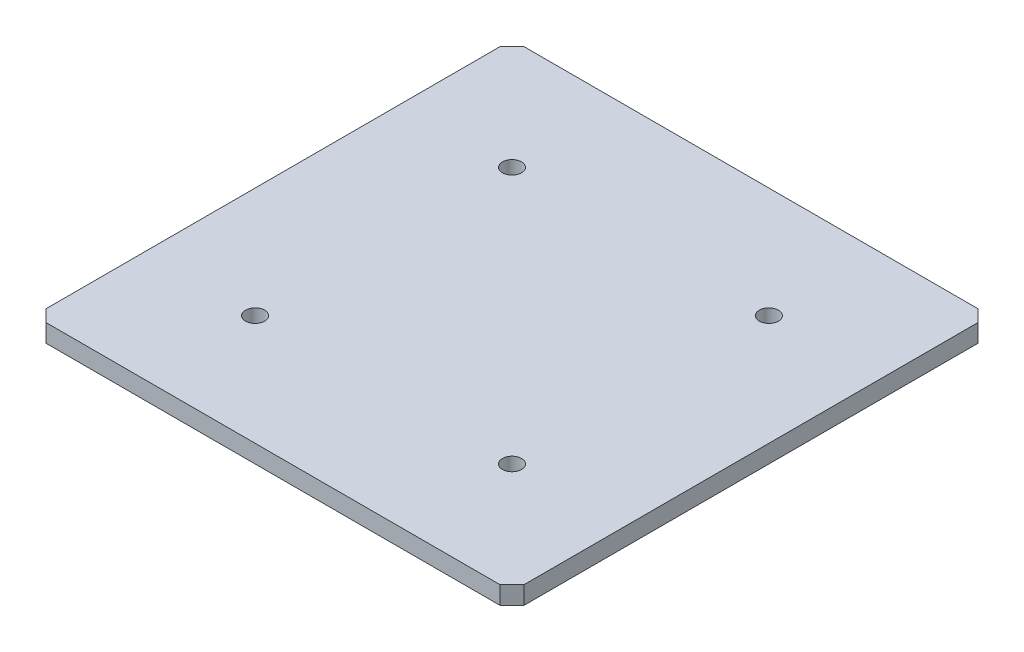
ISO-10303-21;
HEADER;
FILE_DESCRIPTION(('STEP AP214'),'2;1');
FILE_NAME('part.step','',(''),(''),'','','');
FILE_SCHEMA(('AUTOMOTIVE_DESIGN { 1 0 10303 214 1 1 1 1 }'));
ENDSEC;
DATA;
#1=APPLICATION_CONTEXT('core data for automotive mechanical design processes');
#2=APPLICATION_PROTOCOL_DEFINITION('international standard','automotive_design',2000,#1);
#3=PRODUCT_CONTEXT('',#1,'mechanical');
#4=PRODUCT('Part','Part','',(#3));
#5=PRODUCT_RELATED_PRODUCT_CATEGORY('part','',(#4));
#6=PRODUCT_DEFINITION_FORMATION('','',#4);
#7=PRODUCT_DEFINITION_CONTEXT('part definition',#1,'design');
#8=PRODUCT_DEFINITION('design','',#6,#7);
#9=PRODUCT_DEFINITION_SHAPE('','',#8);
#10=(LENGTH_UNIT() NAMED_UNIT(*) SI_UNIT(.MILLI.,.METRE.));
#11=(NAMED_UNIT(*) PLANE_ANGLE_UNIT() SI_UNIT($,.RADIAN.));
#12=(NAMED_UNIT(*) SI_UNIT($,.STERADIAN.) SOLID_ANGLE_UNIT());
#13=UNCERTAINTY_MEASURE_WITH_UNIT(LENGTH_MEASURE(1.E-05),#10,'distance_accuracy_value','');
#14=(GEOMETRIC_REPRESENTATION_CONTEXT(3) GLOBAL_UNCERTAINTY_ASSIGNED_CONTEXT((#13)) GLOBAL_UNIT_ASSIGNED_CONTEXT((#10,
#11,#12)) REPRESENTATION_CONTEXT('',''));
#15=CARTESIAN_POINT('',(0.,0.,0.));
#16=DIRECTION('',(0.,0.,1.));
#17=DIRECTION('',(1.,0.,0.));
#18=AXIS2_PLACEMENT_3D('',#15,#16,#17);
#19=CARTESIAN_POINT('',(0.,7.5,0.));
#20=DIRECTION('',(1.,0.,0.));
#21=DIRECTION('',(0.,0.,-1.));
#22=AXIS2_PLACEMENT_3D('',#19,#20,#21);
#23=PLANE('',#22);
#24=DIRECTION('',(0.,0.,1.));
#25=VECTOR('',#24,1.);
#26=CARTESIAN_POINT('',(0.,7.5,0.));
#27=LINE('',#26,#25);
#28=CARTESIAN_POINT('',(0.,7.5,-390.));
#29=VERTEX_POINT('',#28);
#30=CARTESIAN_POINT('',(0.,7.5,-10.0000000000001));
#31=VERTEX_POINT('',#30);
#32=EDGE_CURVE('E132',#29,#31,#27,.T.);
#33=ORIENTED_EDGE('',*,*,#32,.F.);
#34=DIRECTION('',(0.,-1.,0.));
#35=VECTOR('',#34,1.);
#36=CARTESIAN_POINT('',(0.,7.5,-390.));
#37=LINE('',#36,#35);
#38=CARTESIAN_POINT('',(0.,-7.5,-390.));
#39=VERTEX_POINT('',#38);
#40=EDGE_CURVE('E116',#29,#39,#37,.T.);
#41=ORIENTED_EDGE('',*,*,#40,.T.);
#42=DIRECTION('',(0.,0.,1.));
#43=VECTOR('',#42,1.);
#44=CARTESIAN_POINT('',(0.,-7.5,0.));
#45=LINE('',#44,#43);
#46=CARTESIAN_POINT('',(0.,-7.5,-10.0000000000001));
#47=VERTEX_POINT('',#46);
#48=EDGE_CURVE('E129',#39,#47,#45,.T.);
#49=ORIENTED_EDGE('',*,*,#48,.T.);
#50=DIRECTION('',(0.,1.,0.));
#51=VECTOR('',#50,1.);
#52=CARTESIAN_POINT('',(0.,7.5,-10.0000000000001));
#53=LINE('',#52,#51);
#54=EDGE_CURVE('E135',#47,#31,#53,.T.);
#55=ORIENTED_EDGE('',*,*,#54,.T.);
#56=EDGE_LOOP('',(#33,#41,#49,#55));
#57=FACE_BOUND('',#56,.T.);
#58=ADVANCED_FACE('F41',(#57),#23,.F.);
#59=CARTESIAN_POINT('',(0.,7.5,0.));
#60=DIRECTION('',(0.,0.,-1.));
#61=DIRECTION('',(-1.,0.,0.));
#62=AXIS2_PLACEMENT_3D('',#59,#60,#61);
#63=PLANE('',#62);
#64=DIRECTION('',(1.,0.,0.));
#65=VECTOR('',#64,1.);
#66=CARTESIAN_POINT('',(0.,7.5,0.));
#67=LINE('',#66,#65);
#68=CARTESIAN_POINT('',(10.,7.5,0.));
#69=VERTEX_POINT('',#68);
#70=CARTESIAN_POINT('',(390.,7.5,0.));
#71=VERTEX_POINT('',#70);
#72=EDGE_CURVE('E236',#69,#71,#67,.T.);
#73=ORIENTED_EDGE('',*,*,#72,.F.);
#74=DIRECTION('',(0.,-1.,0.));
#75=VECTOR('',#74,1.);
#76=CARTESIAN_POINT('',(10.,7.5,0.));
#77=LINE('',#76,#75);
#78=CARTESIAN_POINT('',(10.,-7.5,0.));
#79=VERTEX_POINT('',#78);
#80=EDGE_CURVE('E11',#69,#79,#77,.T.);
#81=ORIENTED_EDGE('',*,*,#80,.T.);
#82=DIRECTION('',(1.,0.,0.));
#83=VECTOR('',#82,1.);
#84=CARTESIAN_POINT('',(0.,-7.5,0.));
#85=LINE('',#84,#83);
#86=CARTESIAN_POINT('',(390.,-7.5,0.));
#87=VERTEX_POINT('',#86);
#88=EDGE_CURVE('E141',#79,#87,#85,.T.);
#89=ORIENTED_EDGE('',*,*,#88,.T.);
#90=DIRECTION('',(0.,1.,0.));
#91=VECTOR('',#90,1.);
#92=CARTESIAN_POINT('',(390.,7.5,0.));
#93=LINE('',#92,#91);
#94=EDGE_CURVE('E52',#87,#71,#93,.T.);
#95=ORIENTED_EDGE('',*,*,#94,.T.);
#96=EDGE_LOOP('',(#73,#81,#89,#95));
#97=FACE_BOUND('',#96,.T.);
#98=ADVANCED_FACE('F256',(#97),#63,.F.);
#99=CARTESIAN_POINT('',(400.,7.5,0.));
#100=DIRECTION('',(-1.,0.,0.));
#101=DIRECTION('',(0.,0.,1.));
#102=AXIS2_PLACEMENT_3D('',#99,#100,#101);
#103=PLANE('',#102);
#104=DIRECTION('',(0.,0.,-1.));
#105=VECTOR('',#104,1.);
#106=CARTESIAN_POINT('',(400.,-7.5,0.));
#107=LINE('',#106,#105);
#108=CARTESIAN_POINT('',(400.,-7.5,-10.));
#109=VERTEX_POINT('',#108);
#110=CARTESIAN_POINT('',(400.,-7.5,-390.));
#111=VERTEX_POINT('',#110);
#112=EDGE_CURVE('E146',#109,#111,#107,.T.);
#113=ORIENTED_EDGE('',*,*,#112,.T.);
#114=DIRECTION('',(0.,1.,0.));
#115=VECTOR('',#114,1.);
#116=CARTESIAN_POINT('',(400.,7.5,-390.));
#117=LINE('',#116,#115);
#118=CARTESIAN_POINT('',(400.,7.5,-390.));
#119=VERTEX_POINT('',#118);
#120=EDGE_CURVE('E60',#111,#119,#117,.T.);
#121=ORIENTED_EDGE('',*,*,#120,.T.);
#122=DIRECTION('',(0.,0.,-1.));
#123=VECTOR('',#122,1.);
#124=CARTESIAN_POINT('',(400.,7.5,0.));
#125=LINE('',#124,#123);
#126=CARTESIAN_POINT('',(400.,7.5,-10.));
#127=VERTEX_POINT('',#126);
#128=EDGE_CURVE('E238',#127,#119,#125,.T.);
#129=ORIENTED_EDGE('',*,*,#128,.F.);
#130=DIRECTION('',(0.,-1.,0.));
#131=VECTOR('',#130,1.);
#132=CARTESIAN_POINT('',(400.,7.5,-10.));
#133=LINE('',#132,#131);
#134=EDGE_CURVE('E183',#127,#109,#133,.T.);
#135=ORIENTED_EDGE('',*,*,#134,.T.);
#136=EDGE_LOOP('',(#113,#121,#129,#135));
#137=FACE_BOUND('',#136,.T.);
#138=ADVANCED_FACE('F250',(#137),#103,.F.);
#139=CARTESIAN_POINT('',(0.,7.5,-400.));
#140=DIRECTION('',(0.,0.,1.));
#141=DIRECTION('',(1.,0.,0.));
#142=AXIS2_PLACEMENT_3D('',#139,#140,#141);
#143=PLANE('',#142);
#144=DIRECTION('',(-1.,0.,0.));
#145=VECTOR('',#144,1.);
#146=CARTESIAN_POINT('',(0.,-7.5,-400.));
#147=LINE('',#146,#145);
#148=CARTESIAN_POINT('',(390.,-7.5,-400.));
#149=VERTEX_POINT('',#148);
#150=CARTESIAN_POINT('',(10.,-7.5,-400.));
#151=VERTEX_POINT('',#150);
#152=EDGE_CURVE('E156',#149,#151,#147,.T.);
#153=ORIENTED_EDGE('',*,*,#152,.T.);
#154=DIRECTION('',(0.,1.,0.));
#155=VECTOR('',#154,1.);
#156=CARTESIAN_POINT('',(10.,7.5,-400.));
#157=LINE('',#156,#155);
#158=CARTESIAN_POINT('',(10.,7.5,-400.));
#159=VERTEX_POINT('',#158);
#160=EDGE_CURVE('E117',#151,#159,#157,.T.);
#161=ORIENTED_EDGE('',*,*,#160,.T.);
#162=DIRECTION('',(-1.,0.,0.));
#163=VECTOR('',#162,1.);
#164=CARTESIAN_POINT('',(0.,7.5,-400.));
#165=LINE('',#164,#163);
#166=CARTESIAN_POINT('',(390.,7.5,-400.));
#167=VERTEX_POINT('',#166);
#168=EDGE_CURVE('E151',#167,#159,#165,.T.);
#169=ORIENTED_EDGE('',*,*,#168,.F.);
#170=DIRECTION('',(0.,-1.,0.));
#171=VECTOR('',#170,1.);
#172=CARTESIAN_POINT('',(390.,7.5,-400.));
#173=LINE('',#172,#171);
#174=EDGE_CURVE('E123',#167,#149,#173,.T.);
#175=ORIENTED_EDGE('',*,*,#174,.T.);
#176=EDGE_LOOP('',(#153,#161,#169,#175));
#177=FACE_BOUND('',#176,.T.);
#178=ADVANCED_FACE('F246',(#177),#143,.F.);
#179=CARTESIAN_POINT('',(0.,7.5,0.));
#180=DIRECTION('',(0.,-1.,0.));
#181=DIRECTION('',(0.,0.,-1.));
#182=AXIS2_PLACEMENT_3D('',#179,#180,#181);
#183=PLANE('',#182);
#184=CARTESIAN_POINT('',(92.5000000000011,7.5,-307.499999999998));
#185=DIRECTION('',(0.,1.,0.));
#186=DIRECTION('',(0.,0.,1.));
#187=AXIS2_PLACEMENT_3D('',#184,#185,#186);
#188=CIRCLE('',#187,7.99999999999997);
#189=CARTESIAN_POINT('',(92.5000000000011,7.5,-299.499999999998));
#190=VERTEX_POINT('',#189);
#191=EDGE_CURVE('E232',#190,#190,#188,.T.);
#192=ORIENTED_EDGE('',*,*,#191,.F.);
#193=EDGE_LOOP('',(#192));
#194=FACE_BOUND('',#193,.T.);
#195=CARTESIAN_POINT('',(92.5000000000022,7.5,-92.4999999999977));
#196=DIRECTION('',(0.,1.,0.));
#197=DIRECTION('',(0.,0.,1.));
#198=AXIS2_PLACEMENT_3D('',#195,#196,#197);
#199=CIRCLE('',#198,7.99999999999997);
#200=CARTESIAN_POINT('',(92.5000000000022,7.5,-84.4999999999977));
#201=VERTEX_POINT('',#200);
#202=EDGE_CURVE('E228',#201,#201,#199,.T.);
#203=ORIENTED_EDGE('',*,*,#202,.F.);
#204=EDGE_LOOP('',(#203));
#205=FACE_BOUND('',#204,.T.);
#206=CARTESIAN_POINT('',(307.500000000003,7.5,-92.4999999999997));
#207=DIRECTION('',(0.,1.,0.));
#208=DIRECTION('',(0.,0.,1.));
#209=AXIS2_PLACEMENT_3D('',#206,#207,#208);
#210=CIRCLE('',#209,7.99999999999997);
#211=CARTESIAN_POINT('',(307.500000000003,7.5,-84.4999999999997));
#212=VERTEX_POINT('',#211);
#213=EDGE_CURVE('E224',#212,#212,#210,.T.);
#214=ORIENTED_EDGE('',*,*,#213,.F.);
#215=EDGE_LOOP('',(#214));
#216=FACE_BOUND('',#215,.T.);
#217=CARTESIAN_POINT('',(307.5,7.5,-307.5));
#218=DIRECTION('',(0.,1.,0.));
#219=DIRECTION('',(0.,0.,1.));
#220=AXIS2_PLACEMENT_3D('',#217,#218,#219);
#221=CIRCLE('',#220,7.99999999999999);
#222=CARTESIAN_POINT('',(307.5,7.5,-299.5));
#223=VERTEX_POINT('',#222);
#224=EDGE_CURVE('E196',#223,#223,#221,.T.);
#225=ORIENTED_EDGE('',*,*,#224,.F.);
#226=EDGE_LOOP('',(#225));
#227=FACE_BOUND('',#226,.T.);
#228=ORIENTED_EDGE('',*,*,#168,.T.);
#229=DIRECTION('',(0.707106781186551,0.,-0.707106781186544));
#230=VECTOR('',#229,1.);
#231=CARTESIAN_POINT('',(0.,7.5,-390.));
#232=LINE('',#231,#230);
#233=EDGE_CURVE('E180',#159,#29,#232,.F.);
#234=ORIENTED_EDGE('',*,*,#233,.T.);
#235=ORIENTED_EDGE('',*,*,#32,.T.);
#236=DIRECTION('',(-0.707106781186546,0.,-0.707106781186549));
#237=VECTOR('',#236,1.);
#238=CARTESIAN_POINT('',(10.,7.5,0.));
#239=LINE('',#238,#237);
#240=EDGE_CURVE('E174',#31,#69,#239,.F.);
#241=ORIENTED_EDGE('',*,*,#240,.T.);
#242=ORIENTED_EDGE('',*,*,#72,.T.);
#243=DIRECTION('',(-0.707106781186549,0.,0.707106781186546));
#244=VECTOR('',#243,1.);
#245=CARTESIAN_POINT('',(400.,7.5,-10.));
#246=LINE('',#245,#244);
#247=EDGE_CURVE('E67',#71,#127,#246,.F.);
#248=ORIENTED_EDGE('',*,*,#247,.T.);
#249=ORIENTED_EDGE('',*,*,#128,.T.);
#250=DIRECTION('',(0.707106781186544,0.,0.707106781186551));
#251=VECTOR('',#250,1.);
#252=CARTESIAN_POINT('',(390.,7.5,-400.));
#253=LINE('',#252,#251);
#254=EDGE_CURVE('E177',#119,#167,#253,.F.);
#255=ORIENTED_EDGE('',*,*,#254,.T.);
#256=EDGE_LOOP('',(#228,#234,#235,#241,#242,#248,#249,#255));
#257=FACE_BOUND('',#256,.T.);
#258=ADVANCED_FACE('F208',(#194,#205,#216,#227,#257),#183,.F.);
#259=CARTESIAN_POINT('',(0.,-7.5,0.));
#260=DIRECTION('',(0.,-1.,0.));
#261=DIRECTION('',(0.,0.,-1.));
#262=AXIS2_PLACEMENT_3D('',#259,#260,#261);
#263=PLANE('',#262);
#264=CARTESIAN_POINT('',(92.5000000000011,-7.5,-307.499999999998));
#265=DIRECTION('',(0.,-1.,0.));
#266=DIRECTION('',(0.,0.,-1.));
#267=AXIS2_PLACEMENT_3D('',#264,#265,#266);
#268=CIRCLE('',#267,7.99999999999997);
#269=CARTESIAN_POINT('',(92.5000000000011,-7.5,-315.499999999998));
#270=VERTEX_POINT('',#269);
#271=EDGE_CURVE('E46',#270,#270,#268,.T.);
#272=ORIENTED_EDGE('',*,*,#271,.F.);
#273=EDGE_LOOP('',(#272));
#274=FACE_BOUND('',#273,.T.);
#275=CARTESIAN_POINT('',(92.5000000000022,-7.5,-92.4999999999977));
#276=DIRECTION('',(0.,-1.,0.));
#277=DIRECTION('',(0.,0.,-1.));
#278=AXIS2_PLACEMENT_3D('',#275,#276,#277);
#279=CIRCLE('',#278,7.99999999999997);
#280=CARTESIAN_POINT('',(92.5000000000022,-7.5,-100.499999999998));
#281=VERTEX_POINT('',#280);
#282=EDGE_CURVE('E149',#281,#281,#279,.T.);
#283=ORIENTED_EDGE('',*,*,#282,.F.);
#284=EDGE_LOOP('',(#283));
#285=FACE_BOUND('',#284,.T.);
#286=CARTESIAN_POINT('',(307.500000000003,-7.5,-92.4999999999997));
#287=DIRECTION('',(0.,-1.,0.));
#288=DIRECTION('',(0.,0.,-1.));
#289=AXIS2_PLACEMENT_3D('',#286,#287,#288);
#290=CIRCLE('',#289,7.99999999999997);
#291=CARTESIAN_POINT('',(307.500000000003,-7.5,-100.5));
#292=VERTEX_POINT('',#291);
#293=EDGE_CURVE('E195',#292,#292,#290,.T.);
#294=ORIENTED_EDGE('',*,*,#293,.F.);
#295=EDGE_LOOP('',(#294));
#296=FACE_BOUND('',#295,.T.);
#297=CARTESIAN_POINT('',(307.5,-7.5,-307.5));
#298=DIRECTION('',(0.,-1.,0.));
#299=DIRECTION('',(0.,0.,-1.));
#300=AXIS2_PLACEMENT_3D('',#297,#298,#299);
#301=CIRCLE('',#300,7.99999999999999);
#302=CARTESIAN_POINT('',(307.5,-7.5,-315.5));
#303=VERTEX_POINT('',#302);
#304=EDGE_CURVE('E191',#303,#303,#301,.T.);
#305=ORIENTED_EDGE('',*,*,#304,.F.);
#306=EDGE_LOOP('',(#305));
#307=FACE_BOUND('',#306,.T.);
#308=ORIENTED_EDGE('',*,*,#48,.F.);
#309=DIRECTION('',(-0.707106781186551,0.,0.707106781186544));
#310=VECTOR('',#309,1.);
#311=CARTESIAN_POINT('',(-195.,-7.5,-195.000000000002));
#312=LINE('',#311,#310);
#313=EDGE_CURVE('E112',#39,#151,#312,.F.);
#314=ORIENTED_EDGE('',*,*,#313,.T.);
#315=ORIENTED_EDGE('',*,*,#152,.F.);
#316=DIRECTION('',(-0.707106781186544,0.,-0.707106781186551));
#317=VECTOR('',#316,1.);
#318=CARTESIAN_POINT('',(395.000000000002,-7.5,-394.999999999998));
#319=LINE('',#318,#317);
#320=EDGE_CURVE('E124',#149,#111,#319,.F.);
#321=ORIENTED_EDGE('',*,*,#320,.T.);
#322=ORIENTED_EDGE('',*,*,#112,.F.);
#323=DIRECTION('',(0.707106781186549,0.,-0.707106781186546));
#324=VECTOR('',#323,1.);
#325=CARTESIAN_POINT('',(194.999999999999,-7.5,195.));
#326=LINE('',#325,#324);
#327=EDGE_CURVE('E134',#109,#87,#326,.F.);
#328=ORIENTED_EDGE('',*,*,#327,.T.);
#329=ORIENTED_EDGE('',*,*,#88,.F.);
#330=DIRECTION('',(0.707106781186546,0.,0.707106781186549));
#331=VECTOR('',#330,1.);
#332=CARTESIAN_POINT('',(5.00000000000003,-7.5,-5.));
#333=LINE('',#332,#331);
#334=EDGE_CURVE('E139',#79,#47,#333,.F.);
#335=ORIENTED_EDGE('',*,*,#334,.T.);
#336=EDGE_LOOP('',(#308,#314,#315,#321,#322,#328,#329,#335));
#337=FACE_BOUND('',#336,.T.);
#338=ADVANCED_FACE('F137',(#274,#285,#296,#307,#337),#263,.T.);
#339=CARTESIAN_POINT('',(0.,7.5,-390.));
#340=DIRECTION('',(0.707106781186544,0.,0.707106781186551));
#341=DIRECTION('',(0.,-1.,0.));
#342=AXIS2_PLACEMENT_3D('',#339,#340,#341);
#343=PLANE('',#342);
#344=ORIENTED_EDGE('',*,*,#233,.F.);
#345=ORIENTED_EDGE('',*,*,#160,.F.);
#346=ORIENTED_EDGE('',*,*,#313,.F.);
#347=ORIENTED_EDGE('',*,*,#40,.F.);
#348=EDGE_LOOP('',(#344,#345,#346,#347));
#349=FACE_BOUND('',#348,.T.);
#350=ADVANCED_FACE('F115',(#349),#343,.F.);
#351=CARTESIAN_POINT('',(390.,7.5,-400.));
#352=DIRECTION('',(-0.707106781186551,0.,0.707106781186544));
#353=DIRECTION('',(0.,-1.,0.));
#354=AXIS2_PLACEMENT_3D('',#351,#352,#353);
#355=PLANE('',#354);
#356=ORIENTED_EDGE('',*,*,#254,.F.);
#357=ORIENTED_EDGE('',*,*,#120,.F.);
#358=ORIENTED_EDGE('',*,*,#320,.F.);
#359=ORIENTED_EDGE('',*,*,#174,.F.);
#360=EDGE_LOOP('',(#356,#357,#358,#359));
#361=FACE_BOUND('',#360,.T.);
#362=ADVANCED_FACE('F248',(#361),#355,.F.);
#363=CARTESIAN_POINT('',(10.,7.5,0.));
#364=DIRECTION('',(0.707106781186549,0.,-0.707106781186545));
#365=DIRECTION('',(0.,-1.,0.));
#366=AXIS2_PLACEMENT_3D('',#363,#364,#365);
#367=PLANE('',#366);
#368=ORIENTED_EDGE('',*,*,#240,.F.);
#369=ORIENTED_EDGE('',*,*,#54,.F.);
#370=ORIENTED_EDGE('',*,*,#334,.F.);
#371=ORIENTED_EDGE('',*,*,#80,.F.);
#372=EDGE_LOOP('',(#368,#369,#370,#371));
#373=FACE_BOUND('',#372,.T.);
#374=ADVANCED_FACE('F260',(#373),#367,.F.);
#375=CARTESIAN_POINT('',(400.,7.5,-10.));
#376=DIRECTION('',(-0.707106781186545,0.,-0.707106781186549));
#377=DIRECTION('',(0.,-1.,0.));
#378=AXIS2_PLACEMENT_3D('',#375,#376,#377);
#379=PLANE('',#378);
#380=ORIENTED_EDGE('',*,*,#247,.F.);
#381=ORIENTED_EDGE('',*,*,#94,.F.);
#382=ORIENTED_EDGE('',*,*,#327,.F.);
#383=ORIENTED_EDGE('',*,*,#134,.F.);
#384=EDGE_LOOP('',(#380,#381,#382,#383));
#385=FACE_BOUND('',#384,.T.);
#386=ADVANCED_FACE('F44',(#385),#379,.F.);
#387=CARTESIAN_POINT('',(307.5,-8.5,-307.5));
#388=DIRECTION('',(0.,1.,0.));
#389=DIRECTION('',(0.,0.,1.));
#390=AXIS2_PLACEMENT_3D('',#387,#388,#389);
#391=CYLINDRICAL_SURFACE('',#390,7.99999999999999);
#392=ORIENTED_EDGE('',*,*,#304,.T.);
#393=EDGE_LOOP('',(#392));
#394=FACE_BOUND('',#393,.T.);
#395=ORIENTED_EDGE('',*,*,#224,.T.);
#396=EDGE_LOOP('',(#395));
#397=FACE_BOUND('',#396,.T.);
#398=ADVANCED_FACE('F215',(#394,#397),#391,.F.);
#399=CARTESIAN_POINT('',(307.500000000003,-8.5,-92.4999999999997));
#400=DIRECTION('',(0.,1.,0.));
#401=DIRECTION('',(0.,0.,1.));
#402=AXIS2_PLACEMENT_3D('',#399,#400,#401);
#403=CYLINDRICAL_SURFACE('',#402,7.99999999999997);
#404=ORIENTED_EDGE('',*,*,#293,.T.);
#405=EDGE_LOOP('',(#404));
#406=FACE_BOUND('',#405,.T.);
#407=ORIENTED_EDGE('',*,*,#213,.T.);
#408=EDGE_LOOP('',(#407));
#409=FACE_BOUND('',#408,.T.);
#410=ADVANCED_FACE('F218',(#406,#409),#403,.F.);
#411=CARTESIAN_POINT('',(92.5000000000022,-8.5,-92.4999999999977));
#412=DIRECTION('',(0.,1.,0.));
#413=DIRECTION('',(0.,0.,1.));
#414=AXIS2_PLACEMENT_3D('',#411,#412,#413);
#415=CYLINDRICAL_SURFACE('',#414,7.99999999999997);
#416=ORIENTED_EDGE('',*,*,#282,.T.);
#417=EDGE_LOOP('',(#416));
#418=FACE_BOUND('',#417,.T.);
#419=ORIENTED_EDGE('',*,*,#202,.T.);
#420=EDGE_LOOP('',(#419));
#421=FACE_BOUND('',#420,.T.);
#422=ADVANCED_FACE('F203',(#418,#421),#415,.F.);
#423=CARTESIAN_POINT('',(92.5000000000011,-8.5,-307.499999999998));
#424=DIRECTION('',(0.,1.,0.));
#425=DIRECTION('',(0.,0.,1.));
#426=AXIS2_PLACEMENT_3D('',#423,#424,#425);
#427=CYLINDRICAL_SURFACE('',#426,7.99999999999997);
#428=ORIENTED_EDGE('',*,*,#271,.T.);
#429=EDGE_LOOP('',(#428));
#430=FACE_BOUND('',#429,.T.);
#431=ORIENTED_EDGE('',*,*,#191,.T.);
#432=EDGE_LOOP('',(#431));
#433=FACE_BOUND('',#432,.T.);
#434=ADVANCED_FACE('F345',(#430,#433),#427,.F.);
#435=CLOSED_SHELL('',(#58,#98,#138,#178,#258,#338,#350,#362,#374,#386,#398,#410,#422,#434));
#436=MANIFOLD_SOLID_BREP('B2',#435);
#437=ADVANCED_BREP_SHAPE_REPRESENTATION('',(#18,#436),#14);
#438=SHAPE_DEFINITION_REPRESENTATION(#9,#437);
ENDSEC;
END-ISO-10303-21;
